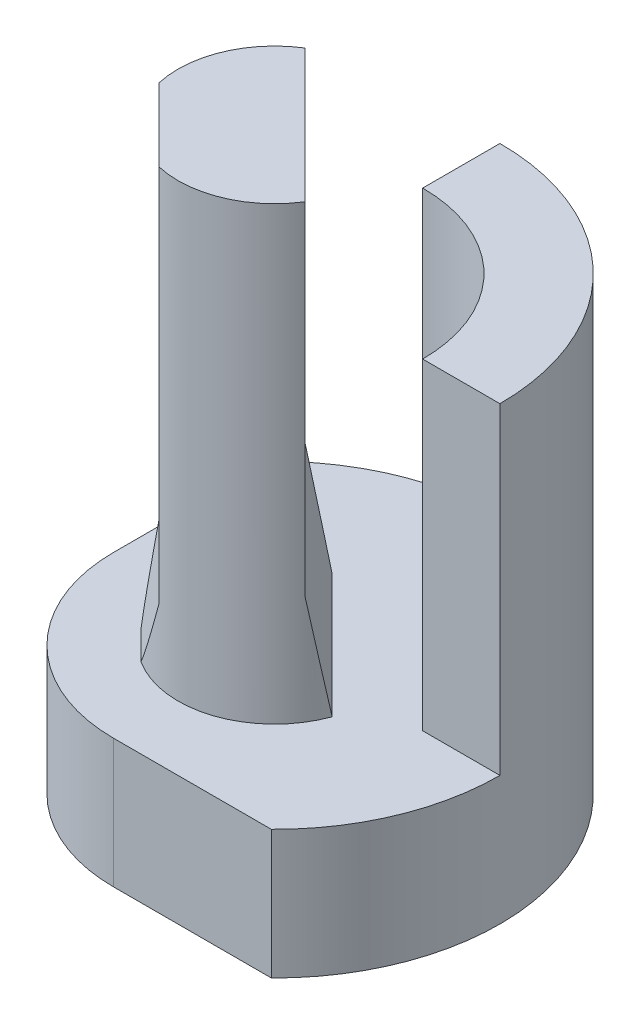
ISO-10303-21;
HEADER;
FILE_DESCRIPTION(('STEP AP214'),'2;1');
FILE_NAME('part.step','',(''),(''),'','','');
FILE_SCHEMA(('AUTOMOTIVE_DESIGN { 1 0 10303 214 1 1 1 1 }'));
ENDSEC;
DATA;
#1=APPLICATION_CONTEXT('core data for automotive mechanical design processes');
#2=APPLICATION_PROTOCOL_DEFINITION('international standard','automotive_design',2000,#1);
#3=PRODUCT_CONTEXT('',#1,'mechanical');
#4=PRODUCT('Part','Part','',(#3));
#5=PRODUCT_RELATED_PRODUCT_CATEGORY('part','',(#4));
#6=PRODUCT_DEFINITION_FORMATION('','',#4);
#7=PRODUCT_DEFINITION_CONTEXT('part definition',#1,'design');
#8=PRODUCT_DEFINITION('design','',#6,#7);
#9=PRODUCT_DEFINITION_SHAPE('','',#8);
#10=(LENGTH_UNIT() NAMED_UNIT(*) SI_UNIT(.MILLI.,.METRE.));
#11=(NAMED_UNIT(*) PLANE_ANGLE_UNIT() SI_UNIT($,.RADIAN.));
#12=(NAMED_UNIT(*) SI_UNIT($,.STERADIAN.) SOLID_ANGLE_UNIT());
#13=UNCERTAINTY_MEASURE_WITH_UNIT(LENGTH_MEASURE(1.E-05),#10,'distance_accuracy_value','');
#14=(GEOMETRIC_REPRESENTATION_CONTEXT(3) GLOBAL_UNCERTAINTY_ASSIGNED_CONTEXT((#13)) GLOBAL_UNIT_ASSIGNED_CONTEXT((#10,
#11,#12)) REPRESENTATION_CONTEXT('',''));
#15=CARTESIAN_POINT('',(0.,0.,0.));
#16=DIRECTION('',(0.,0.,1.));
#17=DIRECTION('',(1.,0.,0.));
#18=AXIS2_PLACEMENT_3D('',#15,#16,#17);
#19=CARTESIAN_POINT('',(0.,2.,0.));
#20=DIRECTION('',(0.,1.,0.));
#21=DIRECTION('',(0.,0.,1.));
#22=AXIS2_PLACEMENT_3D('',#19,#20,#21);
#23=PLANE('',#22);
#24=DIRECTION('',(-1.,0.,0.));
#25=VECTOR('',#24,1.);
#26=CARTESIAN_POINT('',(0.,2.,2.5));
#27=LINE('',#26,#25);
#28=CARTESIAN_POINT('',(2.44948974278318,2.,2.5));
#29=VERTEX_POINT('',#28);
#30=CARTESIAN_POINT('',(0.,2.,2.5));
#31=VERTEX_POINT('',#30);
#32=EDGE_CURVE('E163',#29,#31,#27,.T.);
#33=ORIENTED_EDGE('',*,*,#32,.F.);
#34=CARTESIAN_POINT('',(0.,2.,0.));
#35=DIRECTION('',(0.,1.,0.));
#36=DIRECTION('',(0.,0.,1.));
#37=AXIS2_PLACEMENT_3D('',#34,#35,#36);
#38=CIRCLE('',#37,3.5);
#39=CARTESIAN_POINT('',(3.5,2.,0.));
#40=VERTEX_POINT('',#39);
#41=EDGE_CURVE('E248',#29,#40,#38,.T.);
#42=ORIENTED_EDGE('',*,*,#41,.T.);
#43=DIRECTION('',(1.,0.,0.));
#44=VECTOR('',#43,1.);
#45=CARTESIAN_POINT('',(2.3,2.,0.));
#46=LINE('',#45,#44);
#47=CARTESIAN_POINT('',(2.3,2.,0.));
#48=VERTEX_POINT('',#47);
#49=EDGE_CURVE('E203',#48,#40,#46,.T.);
#50=ORIENTED_EDGE('',*,*,#49,.F.);
#51=CARTESIAN_POINT('',(0.,2.,0.));
#52=DIRECTION('',(0.,-1.,0.));
#53=DIRECTION('',(0.,0.,1.));
#54=AXIS2_PLACEMENT_3D('',#51,#52,#53);
#55=CIRCLE('',#54,2.3);
#56=CARTESIAN_POINT('',(0.,2.,-2.3));
#57=VERTEX_POINT('',#56);
#58=EDGE_CURVE('E179',#57,#48,#55,.T.);
#59=ORIENTED_EDGE('',*,*,#58,.F.);
#60=DIRECTION('',(0.,0.,1.));
#61=VECTOR('',#60,1.);
#62=CARTESIAN_POINT('',(0.,2.,-2.3));
#63=LINE('',#62,#61);
#64=CARTESIAN_POINT('',(0.,2.,-3.5));
#65=VERTEX_POINT('',#64);
#66=EDGE_CURVE('E190',#65,#57,#63,.T.);
#67=ORIENTED_EDGE('',*,*,#66,.F.);
#68=CARTESIAN_POINT('',(-2.5,2.,-2.44948974278318));
#69=VERTEX_POINT('',#68);
#70=EDGE_CURVE('E244',#65,#69,#38,.T.);
#71=ORIENTED_EDGE('',*,*,#70,.T.);
#72=DIRECTION('',(0.,0.,-1.));
#73=VECTOR('',#72,1.);
#74=CARTESIAN_POINT('',(-2.5,2.,0.));
#75=LINE('',#74,#73);
#76=CARTESIAN_POINT('',(-2.5,2.,0.));
#77=VERTEX_POINT('',#76);
#78=EDGE_CURVE('E167',#77,#69,#75,.T.);
#79=ORIENTED_EDGE('',*,*,#78,.F.);
#80=CARTESIAN_POINT('',(0.,2.,0.));
#81=DIRECTION('',(0.,-1.,0.));
#82=DIRECTION('',(0.,0.,1.));
#83=AXIS2_PLACEMENT_3D('',#80,#81,#82);
#84=CIRCLE('',#83,2.5);
#85=EDGE_CURVE('E149',#31,#77,#84,.T.);
#86=ORIENTED_EDGE('',*,*,#85,.F.);
#87=EDGE_LOOP('',(#33,#42,#50,#59,#67,#71,#79,#86));
#88=FACE_BOUND('',#87,.T.);
#89=CARTESIAN_POINT('',(0.,2.,0.));
#90=DIRECTION('',(0.,1.,0.));
#91=DIRECTION('',(0.,0.,1.));
#92=AXIS2_PLACEMENT_3D('',#89,#90,#91);
#93=CIRCLE('',#92,1.5);
#94=CARTESIAN_POINT('',(-0.818712561768167,2.,1.25686504494437));
#95=VERTEX_POINT('',#94);
#96=CARTESIAN_POINT('',(1.40894097925804,2.,0.514670104987074));
#97=VERTEX_POINT('',#96);
#98=EDGE_CURVE('E64',#95,#97,#93,.T.);
#99=ORIENTED_EDGE('',*,*,#98,.F.);
#100=DIRECTION('',(-0.707106781186548,0.,-0.707106781186548));
#101=VECTOR('',#100,1.);
#102=CARTESIAN_POINT('',(-1.03778880335627,2.,1.03778880335627));
#103=LINE('',#102,#101);
#104=CARTESIAN_POINT('',(-1.25686504494437,2.,0.818712561768167));
#105=VERTEX_POINT('',#104);
#106=EDGE_CURVE('E278',#95,#105,#103,.T.);
#107=ORIENTED_EDGE('',*,*,#106,.T.);
#108=CARTESIAN_POINT('',(-0.514670104987074,2.,-1.40894097925804));
#109=VERTEX_POINT('',#108);
#110=EDGE_CURVE('E243',#109,#105,#93,.T.);
#111=ORIENTED_EDGE('',*,*,#110,.F.);
#112=DIRECTION('',(0.707106781186547,0.,0.707106781186548));
#113=VECTOR('',#112,1.);
#114=CARTESIAN_POINT('',(0.447135437135481,2.,-0.447135437135481));
#115=LINE('',#114,#113);
#116=EDGE_CURVE('E264',#109,#97,#115,.T.);
#117=ORIENTED_EDGE('',*,*,#116,.T.);
#118=EDGE_LOOP('',(#99,#107,#111,#117));
#119=FACE_BOUND('',#118,.T.);
#120=ADVANCED_FACE('F40',(#88,#119),#23,.T.);
#121=CARTESIAN_POINT('',(0.,9.,0.));
#122=DIRECTION('',(0.,-1.,0.));
#123=DIRECTION('',(0.,0.,-1.));
#124=AXIS2_PLACEMENT_3D('',#121,#122,#123);
#125=CYLINDRICAL_SURFACE('',#124,1.5);
#126=CARTESIAN_POINT('',(0.,9.,0.));
#127=DIRECTION('',(0.,1.,0.));
#128=DIRECTION('',(0.,0.,1.));
#129=AXIS2_PLACEMENT_3D('',#126,#127,#128);
#130=CIRCLE('',#129,1.5);
#131=CARTESIAN_POINT('',(-0.329335349486519,9.,1.4633995447514));
#132=VERTEX_POINT('',#131);
#133=CARTESIAN_POINT('',(1.26930190934426,9.,0.79929510378522));
#134=VERTEX_POINT('',#133);
#135=EDGE_CURVE('E236',#132,#134,#130,.T.);
#136=ORIENTED_EDGE('',*,*,#135,.F.);
#137=DIRECTION('',(0.,-1.,0.));
#138=VECTOR('',#137,1.);
#139=CARTESIAN_POINT('',(-0.329335349486518,9.,1.4633995447514));
#140=LINE('',#139,#138);
#141=CARTESIAN_POINT('',(-0.329335349486518,3.13425636392359,1.4633995447514));
#142=VERTEX_POINT('',#141);
#143=EDGE_CURVE('E232',#132,#142,#140,.T.);
#144=ORIENTED_EDGE('',*,*,#143,.T.);
#145=CARTESIAN_POINT('',(0.,10.3234851222912,0.));
#146=DIRECTION('',(0.69636424032002,-0.173648177666923,-0.69636424032002));
#147=DIRECTION('',(-0.122787803968968,-0.984807753012209,0.122787803968968));
#148=AXIS2_PLACEMENT_3D('',#145,#146,#147);
#149=ELLIPSE('',#148,8.6381557247158,1.5);
#150=EDGE_CURVE('E49',#142,#95,#149,.T.);
#151=ORIENTED_EDGE('',*,*,#150,.T.);
#152=ORIENTED_EDGE('',*,*,#98,.T.);
#153=CARTESIAN_POINT('',(0.,5.58620669890644,0.));
#154=DIRECTION('',(-0.69636424032002,-0.173648177666924,0.69636424032002));
#155=DIRECTION('',(0.122787803968969,-0.984807753012209,-0.122787803968969));
#156=AXIS2_PLACEMENT_3D('',#153,#154,#155);
#157=ELLIPSE('',#156,8.63815572471575,1.5);
#158=CARTESIAN_POINT('',(1.26930190934426,3.70138454588537,0.799295103785221));
#159=VERTEX_POINT('',#158);
#160=EDGE_CURVE('E271',#97,#159,#157,.T.);
#161=ORIENTED_EDGE('',*,*,#160,.T.);
#162=DIRECTION('',(0.,-1.,0.));
#163=VECTOR('',#162,1.);
#164=CARTESIAN_POINT('',(1.26930190934426,9.,0.799295103785221));
#165=LINE('',#164,#163);
#166=EDGE_CURVE('E222',#159,#134,#165,.F.);
#167=ORIENTED_EDGE('',*,*,#166,.T.);
#168=EDGE_LOOP('',(#136,#144,#151,#152,#161,#167));
#169=FACE_BOUND('',#168,.T.);
#170=ADVANCED_FACE('F284',(#169),#125,.T.);
#171=CARTESIAN_POINT('',(0.,2.,0.));
#172=DIRECTION('',(0.,-1.,0.));
#173=DIRECTION('',(0.,0.,-1.));
#174=AXIS2_PLACEMENT_3D('',#171,#172,#173);
#175=CYLINDRICAL_SURFACE('',#174,3.5);
#176=ORIENTED_EDGE('',*,*,#41,.F.);
#177=DIRECTION('',(0.,1.,0.));
#178=VECTOR('',#177,1.);
#179=CARTESIAN_POINT('',(2.44948974278318,0.,2.5));
#180=LINE('',#179,#178);
#181=CARTESIAN_POINT('',(2.44948974278318,0.,2.5));
#182=VERTEX_POINT('',#181);
#183=EDGE_CURVE('E180',#182,#29,#180,.T.);
#184=ORIENTED_EDGE('',*,*,#183,.F.);
#185=CARTESIAN_POINT('',(0.,0.,0.));
#186=DIRECTION('',(0.,1.,0.));
#187=DIRECTION('',(0.,0.,1.));
#188=AXIS2_PLACEMENT_3D('',#185,#186,#187);
#189=CIRCLE('',#188,3.5);
#190=CARTESIAN_POINT('',(-2.5,0.,-2.44948974278318));
#191=VERTEX_POINT('',#190);
#192=EDGE_CURVE('E249',#182,#191,#189,.T.);
#193=ORIENTED_EDGE('',*,*,#192,.T.);
#194=DIRECTION('',(0.,1.,0.));
#195=VECTOR('',#194,1.);
#196=CARTESIAN_POINT('',(-2.5,0.,-2.44948974278318));
#197=LINE('',#196,#195);
#198=EDGE_CURVE('E56',#191,#69,#197,.T.);
#199=ORIENTED_EDGE('',*,*,#198,.T.);
#200=ORIENTED_EDGE('',*,*,#70,.F.);
#201=DIRECTION('',(0.,-1.,0.));
#202=VECTOR('',#201,1.);
#203=CARTESIAN_POINT('',(0.,7.,-3.5));
#204=LINE('',#203,#202);
#205=CARTESIAN_POINT('',(0.,7.,-3.5));
#206=VERTEX_POINT('',#205);
#207=EDGE_CURVE('E212',#206,#65,#204,.T.);
#208=ORIENTED_EDGE('',*,*,#207,.F.);
#209=CARTESIAN_POINT('',(0.,7.,0.));
#210=DIRECTION('',(0.,1.,0.));
#211=DIRECTION('',(0.,0.,1.));
#212=AXIS2_PLACEMENT_3D('',#209,#210,#211);
#213=CIRCLE('',#212,3.5);
#214=CARTESIAN_POINT('',(3.5,7.,0.));
#215=VERTEX_POINT('',#214);
#216=EDGE_CURVE('E193',#215,#206,#213,.T.);
#217=ORIENTED_EDGE('',*,*,#216,.F.);
#218=DIRECTION('',(0.,-1.,0.));
#219=VECTOR('',#218,1.);
#220=CARTESIAN_POINT('',(3.5,7.,0.));
#221=LINE('',#220,#219);
#222=EDGE_CURVE('E215',#215,#40,#221,.T.);
#223=ORIENTED_EDGE('',*,*,#222,.T.);
#224=EDGE_LOOP('',(#176,#184,#193,#199,#200,#208,#217,#223));
#225=FACE_BOUND('',#224,.T.);
#226=ADVANCED_FACE('F322',(#225),#175,.T.);
#227=CARTESIAN_POINT('',(0.,0.,0.));
#228=DIRECTION('',(0.,1.,0.));
#229=DIRECTION('',(0.,0.,1.));
#230=AXIS2_PLACEMENT_3D('',#227,#228,#229);
#231=PLANE('',#230);
#232=ORIENTED_EDGE('',*,*,#192,.F.);
#233=DIRECTION('',(-1.,0.,0.));
#234=VECTOR('',#233,1.);
#235=CARTESIAN_POINT('',(0.,0.,2.5));
#236=LINE('',#235,#234);
#237=CARTESIAN_POINT('',(0.,0.,2.5));
#238=VERTEX_POINT('',#237);
#239=EDGE_CURVE('E152',#182,#238,#236,.T.);
#240=ORIENTED_EDGE('',*,*,#239,.T.);
#241=CARTESIAN_POINT('',(0.,0.,0.));
#242=DIRECTION('',(0.,-1.,0.));
#243=DIRECTION('',(0.,0.,1.));
#244=AXIS2_PLACEMENT_3D('',#241,#242,#243);
#245=CIRCLE('',#244,2.5);
#246=CARTESIAN_POINT('',(-2.5,0.,0.));
#247=VERTEX_POINT('',#246);
#248=EDGE_CURVE('E146',#238,#247,#245,.T.);
#249=ORIENTED_EDGE('',*,*,#248,.T.);
#250=DIRECTION('',(0.,0.,-1.));
#251=VECTOR('',#250,1.);
#252=CARTESIAN_POINT('',(-2.5,0.,0.));
#253=LINE('',#252,#251);
#254=EDGE_CURVE('E154',#247,#191,#253,.T.);
#255=ORIENTED_EDGE('',*,*,#254,.T.);
#256=EDGE_LOOP('',(#232,#240,#249,#255));
#257=FACE_BOUND('',#256,.T.);
#258=ADVANCED_FACE('F161',(#257),#231,.F.);
#259=ORIENTED_EDGE('',*,*,#110,.T.);
#260=CARTESIAN_POINT('',(0.,10.3234851222912,0.));
#261=DIRECTION('',(0.69636424032002,-0.173648177666923,-0.69636424032002));
#262=DIRECTION('',(-0.122787803968968,-0.984807753012209,0.122787803968968));
#263=AXIS2_PLACEMENT_3D('',#260,#261,#262);
#264=ELLIPSE('',#263,8.6381557247158,1.5);
#265=CARTESIAN_POINT('',(-1.4633995447514,3.13425636392359,0.329335349486518));
#266=VERTEX_POINT('',#265);
#267=EDGE_CURVE('E12',#105,#266,#264,.T.);
#268=ORIENTED_EDGE('',*,*,#267,.T.);
#269=DIRECTION('',(0.,-1.,0.));
#270=VECTOR('',#269,1.);
#271=CARTESIAN_POINT('',(-1.4633995447514,9.,0.329335349486518));
#272=LINE('',#271,#270);
#273=CARTESIAN_POINT('',(-1.4633995447514,9.,0.329335349486519));
#274=VERTEX_POINT('',#273);
#275=EDGE_CURVE('E229',#266,#274,#272,.F.);
#276=ORIENTED_EDGE('',*,*,#275,.T.);
#277=CARTESIAN_POINT('',(-0.79929510378522,9.,-1.26930190934426));
#278=VERTEX_POINT('',#277);
#279=EDGE_CURVE('E240',#278,#274,#130,.T.);
#280=ORIENTED_EDGE('',*,*,#279,.F.);
#281=DIRECTION('',(0.,-1.,0.));
#282=VECTOR('',#281,1.);
#283=CARTESIAN_POINT('',(-0.79929510378522,9.,-1.26930190934426));
#284=LINE('',#283,#282);
#285=CARTESIAN_POINT('',(-0.79929510378522,3.70138454588537,-1.26930190934426));
#286=VERTEX_POINT('',#285);
#287=EDGE_CURVE('E225',#278,#286,#284,.T.);
#288=ORIENTED_EDGE('',*,*,#287,.T.);
#289=CARTESIAN_POINT('',(0.,5.58620669890644,0.));
#290=DIRECTION('',(-0.69636424032002,-0.173648177666924,0.69636424032002));
#291=DIRECTION('',(0.122787803968969,-0.984807753012209,-0.122787803968969));
#292=AXIS2_PLACEMENT_3D('',#289,#290,#291);
#293=ELLIPSE('',#292,8.63815572471575,1.5);
#294=EDGE_CURVE('E267',#286,#109,#293,.T.);
#295=ORIENTED_EDGE('',*,*,#294,.T.);
#296=EDGE_LOOP('',(#259,#268,#276,#280,#288,#295));
#297=FACE_BOUND('',#296,.T.);
#298=ADVANCED_FACE('F292',(#297),#125,.T.);
#299=CARTESIAN_POINT('',(0.,9.,0.));
#300=DIRECTION('',(0.,1.,0.));
#301=DIRECTION('',(0.,0.,1.));
#302=AXIS2_PLACEMENT_3D('',#299,#300,#301);
#303=PLANE('',#302);
#304=DIRECTION('',(-0.707106781186548,0.,-0.707106781186548));
#305=VECTOR('',#304,1.);
#306=CARTESIAN_POINT('',(-0.896367447118957,9.,0.896367447118957));
#307=LINE('',#306,#305);
#308=EDGE_CURVE('E256',#132,#274,#307,.T.);
#309=ORIENTED_EDGE('',*,*,#308,.F.);
#310=ORIENTED_EDGE('',*,*,#135,.T.);
#311=DIRECTION('',(0.707106781186547,0.,0.707106781186548));
#312=VECTOR('',#311,1.);
#313=CARTESIAN_POINT('',(0.235003402779518,9.,-0.235003402779518));
#314=LINE('',#313,#312);
#315=EDGE_CURVE('E252',#278,#134,#314,.T.);
#316=ORIENTED_EDGE('',*,*,#315,.F.);
#317=ORIENTED_EDGE('',*,*,#279,.T.);
#318=EDGE_LOOP('',(#309,#310,#316,#317));
#319=FACE_BOUND('',#318,.T.);
#320=ADVANCED_FACE('F304',(#319),#303,.T.);
#321=CARTESIAN_POINT('',(-2.22868760882929,9.,-2.69869441438833));
#322=DIRECTION('',(-0.707106781186548,0.,0.707106781186547));
#323=DIRECTION('',(0.707106781186547,0.,0.707106781186548));
#324=AXIS2_PLACEMENT_3D('',#321,#322,#323);
#325=PLANE('',#324);
#326=ORIENTED_EDGE('',*,*,#166,.F.);
#327=DIRECTION('',(-0.707106781186547,0.,-0.707106781186548));
#328=VECTOR('',#327,1.);
#329=CARTESIAN_POINT('',(-2.22868760882929,3.70138454588537,-2.69869441438833));
#330=LINE('',#329,#328);
#331=EDGE_CURVE('E260',#159,#286,#330,.T.);
#332=ORIENTED_EDGE('',*,*,#331,.T.);
#333=ORIENTED_EDGE('',*,*,#287,.F.);
#334=ORIENTED_EDGE('',*,*,#315,.T.);
#335=EDGE_LOOP('',(#326,#332,#333,#334));
#336=FACE_BOUND('',#335,.T.);
#337=ADVANCED_FACE('F299',(#336),#325,.F.);
#338=CARTESIAN_POINT('',(-3.20321061468485,9.,-1.41047572044694));
#339=DIRECTION('',(0.707106781186547,0.,-0.707106781186547));
#340=DIRECTION('',(-0.707106781186548,0.,-0.707106781186548));
#341=AXIS2_PLACEMENT_3D('',#338,#339,#340);
#342=PLANE('',#341);
#343=ORIENTED_EDGE('',*,*,#275,.F.);
#344=DIRECTION('',(0.707106781186548,0.,0.707106781186548));
#345=VECTOR('',#344,1.);
#346=CARTESIAN_POINT('',(-3.20321061468485,3.13425636392359,-1.41047572044694));
#347=LINE('',#346,#345);
#348=EDGE_CURVE('E274',#266,#142,#347,.T.);
#349=ORIENTED_EDGE('',*,*,#348,.T.);
#350=ORIENTED_EDGE('',*,*,#143,.F.);
#351=ORIENTED_EDGE('',*,*,#308,.T.);
#352=EDGE_LOOP('',(#343,#349,#350,#351));
#353=FACE_BOUND('',#352,.T.);
#354=ADVANCED_FACE('F307',(#353),#342,.F.);
#355=CARTESIAN_POINT('',(0.,7.,0.));
#356=DIRECTION('',(0.,-1.,0.));
#357=DIRECTION('',(0.,0.,-1.));
#358=AXIS2_PLACEMENT_3D('',#355,#356,#357);
#359=CYLINDRICAL_SURFACE('',#358,2.3);
#360=ORIENTED_EDGE('',*,*,#58,.T.);
#361=DIRECTION('',(0.,-1.,0.));
#362=VECTOR('',#361,1.);
#363=CARTESIAN_POINT('',(2.3,7.,0.));
#364=LINE('',#363,#362);
#365=CARTESIAN_POINT('',(2.3,7.,0.));
#366=VERTEX_POINT('',#365);
#367=EDGE_CURVE('E219',#366,#48,#364,.T.);
#368=ORIENTED_EDGE('',*,*,#367,.F.);
#369=CARTESIAN_POINT('',(0.,7.,0.));
#370=DIRECTION('',(0.,-1.,0.));
#371=DIRECTION('',(0.,0.,1.));
#372=AXIS2_PLACEMENT_3D('',#369,#370,#371);
#373=CIRCLE('',#372,2.3);
#374=CARTESIAN_POINT('',(0.,7.,-2.3));
#375=VERTEX_POINT('',#374);
#376=EDGE_CURVE('E185',#375,#366,#373,.T.);
#377=ORIENTED_EDGE('',*,*,#376,.F.);
#378=DIRECTION('',(0.,-1.,0.));
#379=VECTOR('',#378,1.);
#380=CARTESIAN_POINT('',(0.,7.,-2.3));
#381=LINE('',#380,#379);
#382=EDGE_CURVE('E199',#375,#57,#381,.T.);
#383=ORIENTED_EDGE('',*,*,#382,.T.);
#384=EDGE_LOOP('',(#360,#368,#377,#383));
#385=FACE_BOUND('',#384,.T.);
#386=ADVANCED_FACE('F331',(#385),#359,.F.);
#387=CARTESIAN_POINT('',(2.3,7.,0.));
#388=DIRECTION('',(0.,0.,-1.));
#389=DIRECTION('',(-1.,0.,0.));
#390=AXIS2_PLACEMENT_3D('',#387,#388,#389);
#391=PLANE('',#390);
#392=ORIENTED_EDGE('',*,*,#49,.T.);
#393=ORIENTED_EDGE('',*,*,#222,.F.);
#394=DIRECTION('',(1.,0.,0.));
#395=VECTOR('',#394,1.);
#396=CARTESIAN_POINT('',(2.3,7.,0.));
#397=LINE('',#396,#395);
#398=EDGE_CURVE('E189',#366,#215,#397,.T.);
#399=ORIENTED_EDGE('',*,*,#398,.F.);
#400=ORIENTED_EDGE('',*,*,#367,.T.);
#401=EDGE_LOOP('',(#392,#393,#399,#400));
#402=FACE_BOUND('',#401,.T.);
#403=ADVANCED_FACE('F319',(#402),#391,.F.);
#404=CARTESIAN_POINT('',(0.,7.,-2.3));
#405=DIRECTION('',(1.,0.,0.));
#406=DIRECTION('',(0.,0.,-1.));
#407=AXIS2_PLACEMENT_3D('',#404,#405,#406);
#408=PLANE('',#407);
#409=ORIENTED_EDGE('',*,*,#66,.T.);
#410=ORIENTED_EDGE('',*,*,#382,.F.);
#411=DIRECTION('',(0.,0.,1.));
#412=VECTOR('',#411,1.);
#413=CARTESIAN_POINT('',(0.,7.,-2.3));
#414=LINE('',#413,#412);
#415=EDGE_CURVE('E196',#206,#375,#414,.T.);
#416=ORIENTED_EDGE('',*,*,#415,.F.);
#417=ORIENTED_EDGE('',*,*,#207,.T.);
#418=EDGE_LOOP('',(#409,#410,#416,#417));
#419=FACE_BOUND('',#418,.T.);
#420=ADVANCED_FACE('F360',(#419),#408,.F.);
#421=CARTESIAN_POINT('',(0.,7.,0.));
#422=DIRECTION('',(0.,1.,0.));
#423=DIRECTION('',(0.,0.,1.));
#424=AXIS2_PLACEMENT_3D('',#421,#422,#423);
#425=PLANE('',#424);
#426=ORIENTED_EDGE('',*,*,#376,.T.);
#427=ORIENTED_EDGE('',*,*,#398,.T.);
#428=ORIENTED_EDGE('',*,*,#216,.T.);
#429=ORIENTED_EDGE('',*,*,#415,.T.);
#430=EDGE_LOOP('',(#426,#427,#428,#429));
#431=FACE_BOUND('',#430,.T.);
#432=ADVANCED_FACE('F327',(#431),#425,.T.);
#433=CARTESIAN_POINT('',(-2.22868760882929,3.70138454588537,-2.69869441438833));
#434=DIRECTION('',(-0.69636424032002,-0.173648177666924,0.69636424032002));
#435=DIRECTION('',(-0.707106781186547,0.,-0.707106781186548));
#436=AXIS2_PLACEMENT_3D('',#433,#434,#435);
#437=PLANE('',#436);
#438=ORIENTED_EDGE('',*,*,#160,.F.);
#439=ORIENTED_EDGE('',*,*,#116,.F.);
#440=ORIENTED_EDGE('',*,*,#294,.F.);
#441=ORIENTED_EDGE('',*,*,#331,.F.);
#442=EDGE_LOOP('',(#438,#439,#440,#441));
#443=FACE_BOUND('',#442,.T.);
#444=ADVANCED_FACE('F296',(#443),#437,.F.);
#445=CARTESIAN_POINT('',(-3.20321061468485,3.13425636392359,-1.41047572044694));
#446=DIRECTION('',(0.69636424032002,-0.173648177666923,-0.69636424032002));
#447=DIRECTION('',(0.707106781186548,0.,0.707106781186548));
#448=AXIS2_PLACEMENT_3D('',#445,#446,#447);
#449=PLANE('',#448);
#450=ORIENTED_EDGE('',*,*,#267,.F.);
#451=ORIENTED_EDGE('',*,*,#106,.F.);
#452=ORIENTED_EDGE('',*,*,#150,.F.);
#453=ORIENTED_EDGE('',*,*,#348,.F.);
#454=EDGE_LOOP('',(#450,#451,#452,#453));
#455=FACE_BOUND('',#454,.T.);
#456=ADVANCED_FACE('F42',(#455),#449,.F.);
#457=CARTESIAN_POINT('',(0.,0.,0.));
#458=DIRECTION('',(0.,1.,0.));
#459=DIRECTION('',(0.,0.,1.));
#460=AXIS2_PLACEMENT_3D('',#457,#458,#459);
#461=CYLINDRICAL_SURFACE('',#460,2.5);
#462=ORIENTED_EDGE('',*,*,#85,.T.);
#463=DIRECTION('',(0.,1.,0.));
#464=VECTOR('',#463,1.);
#465=CARTESIAN_POINT('',(-2.5,0.,0.));
#466=LINE('',#465,#464);
#467=EDGE_CURVE('E143',#247,#77,#466,.T.);
#468=ORIENTED_EDGE('',*,*,#467,.F.);
#469=ORIENTED_EDGE('',*,*,#248,.F.);
#470=DIRECTION('',(0.,1.,0.));
#471=VECTOR('',#470,1.);
#472=CARTESIAN_POINT('',(0.,0.,2.5));
#473=LINE('',#472,#471);
#474=EDGE_CURVE('E176',#238,#31,#473,.T.);
#475=ORIENTED_EDGE('',*,*,#474,.T.);
#476=EDGE_LOOP('',(#462,#468,#469,#475));
#477=FACE_BOUND('',#476,.T.);
#478=ADVANCED_FACE('F144',(#477),#461,.T.);
#479=CARTESIAN_POINT('',(0.,0.,2.5));
#480=DIRECTION('',(0.,0.,-1.));
#481=DIRECTION('',(-1.,0.,0.));
#482=AXIS2_PLACEMENT_3D('',#479,#480,#481);
#483=PLANE('',#482);
#484=ORIENTED_EDGE('',*,*,#32,.T.);
#485=ORIENTED_EDGE('',*,*,#474,.F.);
#486=ORIENTED_EDGE('',*,*,#239,.F.);
#487=ORIENTED_EDGE('',*,*,#183,.T.);
#488=EDGE_LOOP('',(#484,#485,#486,#487));
#489=FACE_BOUND('',#488,.T.);
#490=ADVANCED_FACE('F335',(#489),#483,.F.);
#491=CARTESIAN_POINT('',(-2.5,0.,0.));
#492=DIRECTION('',(1.,0.,0.));
#493=DIRECTION('',(0.,0.,-1.));
#494=AXIS2_PLACEMENT_3D('',#491,#492,#493);
#495=PLANE('',#494);
#496=ORIENTED_EDGE('',*,*,#78,.T.);
#497=ORIENTED_EDGE('',*,*,#198,.F.);
#498=ORIENTED_EDGE('',*,*,#254,.F.);
#499=ORIENTED_EDGE('',*,*,#467,.T.);
#500=EDGE_LOOP('',(#496,#497,#498,#499));
#501=FACE_BOUND('',#500,.T.);
#502=ADVANCED_FACE('F155',(#501),#495,.F.);
#503=CLOSED_SHELL('',(#120,#170,#226,#258,#298,#320,#337,#354,#386,#403,#420,#432,#444,#456,
#478,#490,#502));
#504=MANIFOLD_SOLID_BREP('B2',#503);
#505=ADVANCED_BREP_SHAPE_REPRESENTATION('',(#18,#504),#14);
#506=SHAPE_DEFINITION_REPRESENTATION(#9,#505);
ENDSEC;
END-ISO-10303-21;
